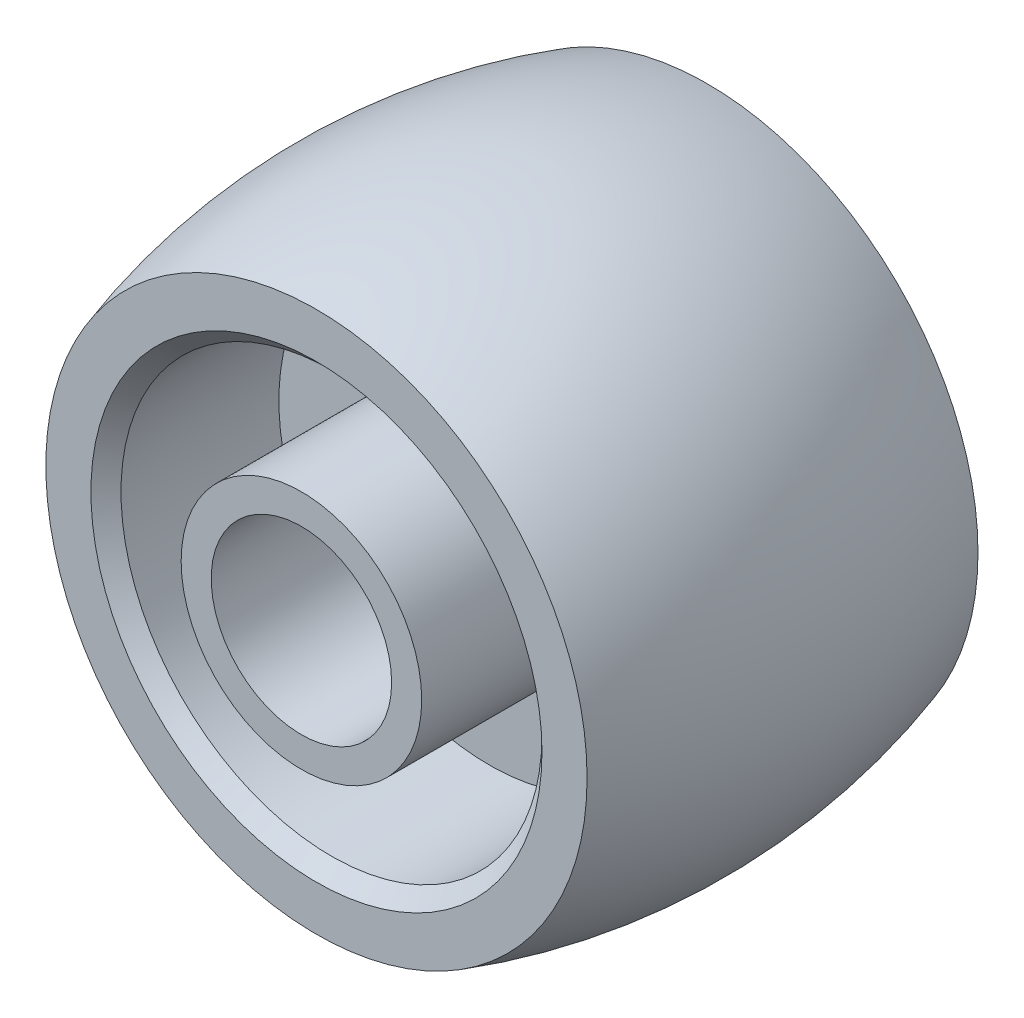
ISO-10303-21;
HEADER;
FILE_DESCRIPTION(('STEP AP214'),'2;1');
FILE_NAME('part.step','',(''),(''),'','','');
FILE_SCHEMA(('AUTOMOTIVE_DESIGN { 1 0 10303 214 1 1 1 1 }'));
ENDSEC;
DATA;
#1=APPLICATION_CONTEXT('core data for automotive mechanical design processes');
#2=APPLICATION_PROTOCOL_DEFINITION('international standard','automotive_design',2000,#1);
#3=PRODUCT_CONTEXT('',#1,'mechanical');
#4=PRODUCT('Part','Part','',(#3));
#5=PRODUCT_RELATED_PRODUCT_CATEGORY('part','',(#4));
#6=PRODUCT_DEFINITION_FORMATION('','',#4);
#7=PRODUCT_DEFINITION_CONTEXT('part definition',#1,'design');
#8=PRODUCT_DEFINITION('design','',#6,#7);
#9=PRODUCT_DEFINITION_SHAPE('','',#8);
#10=(LENGTH_UNIT() NAMED_UNIT(*) SI_UNIT(.MILLI.,.METRE.));
#11=(NAMED_UNIT(*) PLANE_ANGLE_UNIT() SI_UNIT($,.RADIAN.));
#12=(NAMED_UNIT(*) SI_UNIT($,.STERADIAN.) SOLID_ANGLE_UNIT());
#13=UNCERTAINTY_MEASURE_WITH_UNIT(LENGTH_MEASURE(1.E-05),#10,'distance_accuracy_value','');
#14=(GEOMETRIC_REPRESENTATION_CONTEXT(3) GLOBAL_UNCERTAINTY_ASSIGNED_CONTEXT((#13)) GLOBAL_UNIT_ASSIGNED_CONTEXT((#10,
#11,#12)) REPRESENTATION_CONTEXT('',''));
#15=CARTESIAN_POINT('',(0.,0.,0.));
#16=DIRECTION('',(0.,0.,1.));
#17=DIRECTION('',(1.,0.,0.));
#18=AXIS2_PLACEMENT_3D('',#15,#16,#17);
#19=CARTESIAN_POINT('',(0.,0.,6.5));
#20=DIRECTION('',(0.,0.,1.));
#21=DIRECTION('',(1.,0.,0.));
#22=AXIS2_PLACEMENT_3D('',#19,#20,#21);
#23=CONICAL_SURFACE('',#22,7.5,0.785398163397449);
#24=CARTESIAN_POINT('',(0.,0.,6.));
#25=DIRECTION('',(0.,0.,1.));
#26=DIRECTION('',(1.,0.,0.));
#27=AXIS2_PLACEMENT_3D('',#24,#25,#26);
#28=CIRCLE('',#27,7.);
#29=CARTESIAN_POINT('',(7.,0.,6.));
#30=VERTEX_POINT('',#29);
#31=EDGE_CURVE('E10',#30,#30,#28,.T.);
#32=ORIENTED_EDGE('',*,*,#31,.F.);
#33=EDGE_LOOP('',(#32));
#34=FACE_BOUND('',#33,.T.);
#35=CARTESIAN_POINT('',(0.,0.,6.5));
#36=DIRECTION('',(0.,0.,1.));
#37=DIRECTION('',(1.,0.,0.));
#38=AXIS2_PLACEMENT_3D('',#35,#36,#37);
#39=CIRCLE('',#38,7.5);
#40=CARTESIAN_POINT('',(7.5,0.,6.5));
#41=VERTEX_POINT('',#40);
#42=EDGE_CURVE('E77',#41,#41,#39,.T.);
#43=ORIENTED_EDGE('',*,*,#42,.T.);
#44=EDGE_LOOP('',(#43));
#45=FACE_BOUND('',#44,.T.);
#46=ADVANCED_FACE('F31',(#34,#45),#23,.F.);
#47=CARTESIAN_POINT('',(0.,0.,4.71471149988316));
#48=DIRECTION('',(0.,0.,1.));
#49=DIRECTION('',(1.,0.,0.));
#50=AXIS2_PLACEMENT_3D('',#47,#48,#49);
#51=CYLINDRICAL_SURFACE('',#50,7.);
#52=CARTESIAN_POINT('',(0.,0.,0.750000000000001));
#53=DIRECTION('',(0.,0.,1.));
#54=DIRECTION('',(1.,0.,0.));
#55=AXIS2_PLACEMENT_3D('',#52,#53,#54);
#56=CIRCLE('',#55,7.);
#57=CARTESIAN_POINT('',(7.,0.,0.750000000000001));
#58=VERTEX_POINT('',#57);
#59=EDGE_CURVE('E37',#58,#58,#56,.T.);
#60=ORIENTED_EDGE('',*,*,#59,.F.);
#61=EDGE_LOOP('',(#60));
#62=FACE_BOUND('',#61,.T.);
#63=ORIENTED_EDGE('',*,*,#31,.T.);
#64=EDGE_LOOP('',(#63));
#65=FACE_BOUND('',#64,.T.);
#66=ADVANCED_FACE('F150',(#62,#65),#51,.F.);
#67=CARTESIAN_POINT('',(0.,4.,0.75));
#68=DIRECTION('',(0.,0.,-1.));
#69=DIRECTION('',(-1.,0.,0.));
#70=AXIS2_PLACEMENT_3D('',#67,#68,#69);
#71=PLANE('',#70);
#72=CARTESIAN_POINT('',(0.,0.,0.75));
#73=DIRECTION('',(0.,0.,1.));
#74=DIRECTION('',(1.,0.,0.));
#75=AXIS2_PLACEMENT_3D('',#72,#73,#74);
#76=CIRCLE('',#75,4.);
#77=CARTESIAN_POINT('',(4.,0.,0.75));
#78=VERTEX_POINT('',#77);
#79=EDGE_CURVE('E41',#78,#78,#76,.T.);
#80=ORIENTED_EDGE('',*,*,#79,.F.);
#81=EDGE_LOOP('',(#80));
#82=FACE_BOUND('',#81,.T.);
#83=ORIENTED_EDGE('',*,*,#59,.T.);
#84=EDGE_LOOP('',(#83));
#85=FACE_BOUND('',#84,.T.);
#86=ADVANCED_FACE('F145',(#82,#85),#71,.F.);
#87=CARTESIAN_POINT('',(0.,0.,4.71471149988316));
#88=DIRECTION('',(0.,0.,1.));
#89=DIRECTION('',(1.,0.,0.));
#90=AXIS2_PLACEMENT_3D('',#87,#88,#89);
#91=CYLINDRICAL_SURFACE('',#90,4.);
#92=CARTESIAN_POINT('',(0.,0.,7.));
#93=DIRECTION('',(0.,0.,1.));
#94=DIRECTION('',(1.,0.,0.));
#95=AXIS2_PLACEMENT_3D('',#92,#93,#94);
#96=CIRCLE('',#95,4.);
#97=CARTESIAN_POINT('',(4.,0.,7.));
#98=VERTEX_POINT('',#97);
#99=EDGE_CURVE('E45',#98,#98,#96,.T.);
#100=ORIENTED_EDGE('',*,*,#99,.F.);
#101=EDGE_LOOP('',(#100));
#102=FACE_BOUND('',#101,.T.);
#103=ORIENTED_EDGE('',*,*,#79,.T.);
#104=EDGE_LOOP('',(#103));
#105=FACE_BOUND('',#104,.T.);
#106=ADVANCED_FACE('F139',(#102,#105),#91,.T.);
#107=CARTESIAN_POINT('',(0.,3.,7.));
#108=DIRECTION('',(0.,0.,-1.));
#109=DIRECTION('',(-1.,0.,0.));
#110=AXIS2_PLACEMENT_3D('',#107,#108,#109);
#111=PLANE('',#110);
#112=CARTESIAN_POINT('',(0.,0.,7.));
#113=DIRECTION('',(0.,0.,1.));
#114=DIRECTION('',(1.,0.,0.));
#115=AXIS2_PLACEMENT_3D('',#112,#113,#114);
#116=CIRCLE('',#115,3.);
#117=CARTESIAN_POINT('',(3.,0.,7.));
#118=VERTEX_POINT('',#117);
#119=EDGE_CURVE('E50',#118,#118,#116,.T.);
#120=ORIENTED_EDGE('',*,*,#119,.F.);
#121=EDGE_LOOP('',(#120));
#122=FACE_BOUND('',#121,.T.);
#123=ORIENTED_EDGE('',*,*,#99,.T.);
#124=EDGE_LOOP('',(#123));
#125=FACE_BOUND('',#124,.T.);
#126=ADVANCED_FACE('F133',(#122,#125),#111,.F.);
#127=CARTESIAN_POINT('',(0.,0.,4.71471149988316));
#128=DIRECTION('',(0.,0.,1.));
#129=DIRECTION('',(1.,0.,0.));
#130=AXIS2_PLACEMENT_3D('',#127,#128,#129);
#131=CYLINDRICAL_SURFACE('',#130,3.);
#132=CARTESIAN_POINT('',(0.,0.,-7.));
#133=DIRECTION('',(0.,0.,1.));
#134=DIRECTION('',(1.,0.,0.));
#135=AXIS2_PLACEMENT_3D('',#132,#133,#134);
#136=CIRCLE('',#135,3.);
#137=CARTESIAN_POINT('',(3.,0.,-7.));
#138=VERTEX_POINT('',#137);
#139=EDGE_CURVE('E53',#138,#138,#136,.T.);
#140=ORIENTED_EDGE('',*,*,#139,.F.);
#141=EDGE_LOOP('',(#140));
#142=FACE_BOUND('',#141,.T.);
#143=ORIENTED_EDGE('',*,*,#119,.T.);
#144=EDGE_LOOP('',(#143));
#145=FACE_BOUND('',#144,.T.);
#146=ADVANCED_FACE('F127',(#142,#145),#131,.F.);
#147=CARTESIAN_POINT('',(0.,3.,-7.));
#148=DIRECTION('',(0.,0.,1.));
#149=DIRECTION('',(1.,0.,0.));
#150=AXIS2_PLACEMENT_3D('',#147,#148,#149);
#151=PLANE('',#150);
#152=CARTESIAN_POINT('',(0.,0.,-7.));
#153=DIRECTION('',(0.,0.,1.));
#154=DIRECTION('',(1.,0.,0.));
#155=AXIS2_PLACEMENT_3D('',#152,#153,#154);
#156=CIRCLE('',#155,4.);
#157=CARTESIAN_POINT('',(4.,0.,-7.));
#158=VERTEX_POINT('',#157);
#159=EDGE_CURVE('E56',#158,#158,#156,.T.);
#160=ORIENTED_EDGE('',*,*,#159,.F.);
#161=EDGE_LOOP('',(#160));
#162=FACE_BOUND('',#161,.T.);
#163=ORIENTED_EDGE('',*,*,#139,.T.);
#164=EDGE_LOOP('',(#163));
#165=FACE_BOUND('',#164,.T.);
#166=ADVANCED_FACE('F121',(#162,#165),#151,.F.);
#167=CARTESIAN_POINT('',(0.,0.,4.71471149988316));
#168=DIRECTION('',(0.,0.,1.));
#169=DIRECTION('',(1.,0.,0.));
#170=AXIS2_PLACEMENT_3D('',#167,#168,#169);
#171=CYLINDRICAL_SURFACE('',#170,4.);
#172=CARTESIAN_POINT('',(0.,0.,-0.75));
#173=DIRECTION('',(0.,0.,1.));
#174=DIRECTION('',(1.,0.,0.));
#175=AXIS2_PLACEMENT_3D('',#172,#173,#174);
#176=CIRCLE('',#175,4.);
#177=CARTESIAN_POINT('',(4.,0.,-0.75));
#178=VERTEX_POINT('',#177);
#179=EDGE_CURVE('E59',#178,#178,#176,.T.);
#180=ORIENTED_EDGE('',*,*,#179,.F.);
#181=EDGE_LOOP('',(#180));
#182=FACE_BOUND('',#181,.T.);
#183=ORIENTED_EDGE('',*,*,#159,.T.);
#184=EDGE_LOOP('',(#183));
#185=FACE_BOUND('',#184,.T.);
#186=ADVANCED_FACE('F115',(#182,#185),#171,.T.);
#187=CARTESIAN_POINT('',(0.,4.,-0.75));
#188=DIRECTION('',(0.,0.,1.));
#189=DIRECTION('',(1.,0.,0.));
#190=AXIS2_PLACEMENT_3D('',#187,#188,#189);
#191=PLANE('',#190);
#192=CARTESIAN_POINT('',(0.,0.,-0.750000000000001));
#193=DIRECTION('',(0.,0.,1.));
#194=DIRECTION('',(1.,0.,0.));
#195=AXIS2_PLACEMENT_3D('',#192,#193,#194);
#196=CIRCLE('',#195,7.);
#197=CARTESIAN_POINT('',(7.,0.,-0.750000000000001));
#198=VERTEX_POINT('',#197);
#199=EDGE_CURVE('E62',#198,#198,#196,.T.);
#200=ORIENTED_EDGE('',*,*,#199,.F.);
#201=EDGE_LOOP('',(#200));
#202=FACE_BOUND('',#201,.T.);
#203=ORIENTED_EDGE('',*,*,#179,.T.);
#204=EDGE_LOOP('',(#203));
#205=FACE_BOUND('',#204,.T.);
#206=ADVANCED_FACE('F109',(#202,#205),#191,.F.);
#207=CARTESIAN_POINT('',(0.,0.,4.71471149988316));
#208=DIRECTION('',(0.,0.,1.));
#209=DIRECTION('',(1.,0.,0.));
#210=AXIS2_PLACEMENT_3D('',#207,#208,#209);
#211=CYLINDRICAL_SURFACE('',#210,7.);
#212=CARTESIAN_POINT('',(0.,0.,-6.));
#213=DIRECTION('',(0.,0.,1.));
#214=DIRECTION('',(1.,0.,0.));
#215=AXIS2_PLACEMENT_3D('',#212,#213,#214);
#216=CIRCLE('',#215,7.);
#217=CARTESIAN_POINT('',(7.,0.,-6.));
#218=VERTEX_POINT('',#217);
#219=EDGE_CURVE('E65',#218,#218,#216,.T.);
#220=ORIENTED_EDGE('',*,*,#219,.F.);
#221=EDGE_LOOP('',(#220));
#222=FACE_BOUND('',#221,.T.);
#223=ORIENTED_EDGE('',*,*,#199,.T.);
#224=EDGE_LOOP('',(#223));
#225=FACE_BOUND('',#224,.T.);
#226=ADVANCED_FACE('F103',(#222,#225),#211,.F.);
#227=CARTESIAN_POINT('',(0.,0.,-6.));
#228=DIRECTION('',(0.,0.,-1.));
#229=DIRECTION('',(-1.,0.,0.));
#230=AXIS2_PLACEMENT_3D('',#227,#228,#229);
#231=CONICAL_SURFACE('',#230,7.,0.785398163397448);
#232=CARTESIAN_POINT('',(0.,0.,-6.5));
#233=DIRECTION('',(0.,0.,1.));
#234=DIRECTION('',(1.,0.,0.));
#235=AXIS2_PLACEMENT_3D('',#232,#233,#234);
#236=CIRCLE('',#235,7.5);
#237=CARTESIAN_POINT('',(7.5,0.,-6.5));
#238=VERTEX_POINT('',#237);
#239=EDGE_CURVE('E68',#238,#238,#236,.T.);
#240=ORIENTED_EDGE('',*,*,#239,.F.);
#241=EDGE_LOOP('',(#240));
#242=FACE_BOUND('',#241,.T.);
#243=ORIENTED_EDGE('',*,*,#219,.T.);
#244=EDGE_LOOP('',(#243));
#245=FACE_BOUND('',#244,.T.);
#246=ADVANCED_FACE('F97',(#242,#245),#231,.F.);
#247=CARTESIAN_POINT('',(0.,7.5,-6.5));
#248=DIRECTION('',(0.,0.,1.));
#249=DIRECTION('',(1.,0.,0.));
#250=AXIS2_PLACEMENT_3D('',#247,#248,#249);
#251=PLANE('',#250);
#252=CARTESIAN_POINT('',(0.,0.,-6.5));
#253=DIRECTION('',(0.,0.,1.));
#254=DIRECTION('',(1.,0.,0.));
#255=AXIS2_PLACEMENT_3D('',#252,#253,#254);
#256=CIRCLE('',#255,9.);
#257=CARTESIAN_POINT('',(9.,0.,-6.5));
#258=VERTEX_POINT('',#257);
#259=EDGE_CURVE('E71',#258,#258,#256,.T.);
#260=ORIENTED_EDGE('',*,*,#259,.F.);
#261=EDGE_LOOP('',(#260));
#262=FACE_BOUND('',#261,.T.);
#263=ORIENTED_EDGE('',*,*,#239,.T.);
#264=EDGE_LOOP('',(#263));
#265=FACE_BOUND('',#264,.T.);
#266=ADVANCED_FACE('F91',(#262,#265),#251,.F.);
#267=CARTESIAN_POINT('',(0.,0.,0.));
#268=DIRECTION('',(0.,0.,1.));
#269=DIRECTION('',(1.,0.,0.));
#270=AXIS2_PLACEMENT_3D('',#267,#268,#269);
#271=DEGENERATE_TOROIDAL_SURFACE('',#270,11.625,21.625,.F.);
#272=CARTESIAN_POINT('',(0.,0.,6.5));
#273=DIRECTION('',(0.,0.,1.));
#274=DIRECTION('',(1.,0.,0.));
#275=AXIS2_PLACEMENT_3D('',#272,#273,#274);
#276=CIRCLE('',#275,9.);
#277=CARTESIAN_POINT('',(9.,0.,6.5));
#278=VERTEX_POINT('',#277);
#279=EDGE_CURVE('E74',#278,#278,#276,.T.);
#280=ORIENTED_EDGE('',*,*,#279,.F.);
#281=EDGE_LOOP('',(#280));
#282=FACE_BOUND('',#281,.T.);
#283=ORIENTED_EDGE('',*,*,#259,.T.);
#284=EDGE_LOOP('',(#283));
#285=FACE_BOUND('',#284,.T.);
#286=ADVANCED_FACE('F85',(#282,#285),#271,.F.);
#287=CARTESIAN_POINT('',(0.,7.5,6.5));
#288=DIRECTION('',(0.,0.,-1.));
#289=DIRECTION('',(-1.,0.,0.));
#290=AXIS2_PLACEMENT_3D('',#287,#288,#289);
#291=PLANE('',#290);
#292=ORIENTED_EDGE('',*,*,#42,.F.);
#293=EDGE_LOOP('',(#292));
#294=FACE_BOUND('',#293,.T.);
#295=ORIENTED_EDGE('',*,*,#279,.T.);
#296=EDGE_LOOP('',(#295));
#297=FACE_BOUND('',#296,.T.);
#298=ADVANCED_FACE('F82',(#294,#297),#291,.F.);
#299=CLOSED_SHELL('',(#46,#66,#86,#106,#126,#146,#166,#186,#206,#226,#246,#266,#286,#298));
#300=MANIFOLD_SOLID_BREP('B2',#299);
#301=ADVANCED_BREP_SHAPE_REPRESENTATION('',(#18,#300),#14);
#302=SHAPE_DEFINITION_REPRESENTATION(#9,#301);
ENDSEC;
END-ISO-10303-21;
